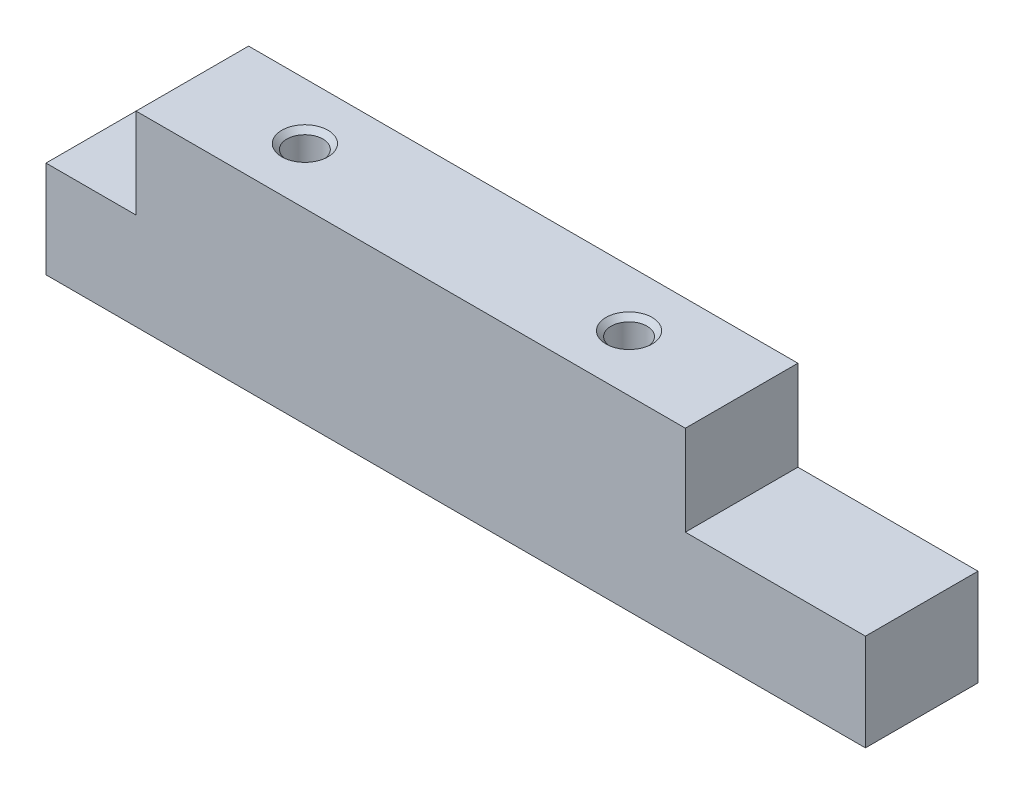
ISO-10303-21;
HEADER;
FILE_DESCRIPTION(('STEP AP214'),'2;1');
FILE_NAME('part.step','',(''),(''),'','','');
FILE_SCHEMA(('AUTOMOTIVE_DESIGN { 1 0 10303 214 1 1 1 1 }'));
ENDSEC;
DATA;
#1=APPLICATION_CONTEXT('core data for automotive mechanical design processes');
#2=APPLICATION_PROTOCOL_DEFINITION('international standard','automotive_design',2000,#1);
#3=PRODUCT_CONTEXT('',#1,'mechanical');
#4=PRODUCT('Part','Part','',(#3));
#5=PRODUCT_RELATED_PRODUCT_CATEGORY('part','',(#4));
#6=PRODUCT_DEFINITION_FORMATION('','',#4);
#7=PRODUCT_DEFINITION_CONTEXT('part definition',#1,'design');
#8=PRODUCT_DEFINITION('design','',#6,#7);
#9=PRODUCT_DEFINITION_SHAPE('','',#8);
#10=(LENGTH_UNIT() NAMED_UNIT(*) SI_UNIT(.MILLI.,.METRE.));
#11=(NAMED_UNIT(*) PLANE_ANGLE_UNIT() SI_UNIT($,.RADIAN.));
#12=(NAMED_UNIT(*) SI_UNIT($,.STERADIAN.) SOLID_ANGLE_UNIT());
#13=UNCERTAINTY_MEASURE_WITH_UNIT(LENGTH_MEASURE(1.E-05),#10,'distance_accuracy_value','');
#14=(GEOMETRIC_REPRESENTATION_CONTEXT(3) GLOBAL_UNCERTAINTY_ASSIGNED_CONTEXT((#13)) GLOBAL_UNIT_ASSIGNED_CONTEXT((#10,
#11,#12)) REPRESENTATION_CONTEXT('',''));
#15=CARTESIAN_POINT('',(0.,0.,0.));
#16=DIRECTION('',(0.,0.,1.));
#17=DIRECTION('',(1.,0.,0.));
#18=AXIS2_PLACEMENT_3D('',#15,#16,#17);
#19=CARTESIAN_POINT('',(0.,4.3,0.));
#20=DIRECTION('',(0.,-1.,0.));
#21=DIRECTION('',(0.,0.,-1.));
#22=AXIS2_PLACEMENT_3D('',#19,#20,#21);
#23=PLANE('',#22);
#24=DIRECTION('',(0.,0.,1.));
#25=VECTOR('',#24,1.);
#26=CARTESIAN_POINT('',(4.,4.3,0.));
#27=LINE('',#26,#25);
#28=CARTESIAN_POINT('',(4.,4.3,-5.));
#29=VERTEX_POINT('',#28);
#30=CARTESIAN_POINT('',(4.,4.3,0.));
#31=VERTEX_POINT('',#30);
#32=EDGE_CURVE('E54',#29,#31,#27,.T.);
#33=ORIENTED_EDGE('',*,*,#32,.F.);
#34=DIRECTION('',(-1.,0.,0.));
#35=VECTOR('',#34,1.);
#36=CARTESIAN_POINT('',(0.,4.3,-5.));
#37=LINE('',#36,#35);
#38=CARTESIAN_POINT('',(0.,4.3,-5.));
#39=VERTEX_POINT('',#38);
#40=EDGE_CURVE('E210',#29,#39,#37,.T.);
#41=ORIENTED_EDGE('',*,*,#40,.T.);
#42=DIRECTION('',(0.,0.,1.));
#43=VECTOR('',#42,1.);
#44=CARTESIAN_POINT('',(0.,4.3,0.));
#45=LINE('',#44,#43);
#46=CARTESIAN_POINT('',(0.,4.3,0.));
#47=VERTEX_POINT('',#46);
#48=EDGE_CURVE('E193',#39,#47,#45,.T.);
#49=ORIENTED_EDGE('',*,*,#48,.T.);
#50=DIRECTION('',(1.,0.,0.));
#51=VECTOR('',#50,1.);
#52=CARTESIAN_POINT('',(0.,4.3,0.));
#53=LINE('',#52,#51);
#54=EDGE_CURVE('E202',#47,#31,#53,.T.);
#55=ORIENTED_EDGE('',*,*,#54,.T.);
#56=EDGE_LOOP('',(#33,#41,#49,#55));
#57=FACE_BOUND('',#56,.T.);
#58=ADVANCED_FACE('F37',(#57),#23,.F.);
#59=DIRECTION('',(0.,0.,-1.));
#60=VECTOR('',#59,1.);
#61=CARTESIAN_POINT('',(28.4,4.3,0.));
#62=LINE('',#61,#60);
#63=CARTESIAN_POINT('',(28.4,4.3,0.));
#64=VERTEX_POINT('',#63);
#65=CARTESIAN_POINT('',(28.4,4.3,-5.));
#66=VERTEX_POINT('',#65);
#67=EDGE_CURVE('E62',#64,#66,#62,.T.);
#68=ORIENTED_EDGE('',*,*,#67,.F.);
#69=CARTESIAN_POINT('',(36.4,4.3,0.));
#70=VERTEX_POINT('',#69);
#71=EDGE_CURVE('E206',#64,#70,#53,.T.);
#72=ORIENTED_EDGE('',*,*,#71,.T.);
#73=DIRECTION('',(0.,0.,-1.));
#74=VECTOR('',#73,1.);
#75=CARTESIAN_POINT('',(36.4,4.3,0.));
#76=LINE('',#75,#74);
#77=CARTESIAN_POINT('',(36.4,4.3,-5.));
#78=VERTEX_POINT('',#77);
#79=EDGE_CURVE('E205',#70,#78,#76,.T.);
#80=ORIENTED_EDGE('',*,*,#79,.T.);
#81=EDGE_CURVE('E197',#78,#66,#37,.T.);
#82=ORIENTED_EDGE('',*,*,#81,.T.);
#83=EDGE_LOOP('',(#68,#72,#80,#82));
#84=FACE_BOUND('',#83,.T.);
#85=ADVANCED_FACE('F215',(#84),#23,.F.);
#86=CARTESIAN_POINT('',(0.,4.3,0.));
#87=DIRECTION('',(1.,0.,0.));
#88=DIRECTION('',(0.,0.,-1.));
#89=AXIS2_PLACEMENT_3D('',#86,#87,#88);
#90=PLANE('',#89);
#91=DIRECTION('',(0.,0.,1.));
#92=VECTOR('',#91,1.);
#93=CARTESIAN_POINT('',(0.,0.,0.));
#94=LINE('',#93,#92);
#95=CARTESIAN_POINT('',(0.,0.,-5.));
#96=VERTEX_POINT('',#95);
#97=CARTESIAN_POINT('',(0.,0.,0.));
#98=VERTEX_POINT('',#97);
#99=EDGE_CURVE('E174',#96,#98,#94,.T.);
#100=ORIENTED_EDGE('',*,*,#99,.T.);
#101=DIRECTION('',(0.,-1.,0.));
#102=VECTOR('',#101,1.);
#103=CARTESIAN_POINT('',(0.,4.3,0.));
#104=LINE('',#103,#102);
#105=EDGE_CURVE('E11',#47,#98,#104,.T.);
#106=ORIENTED_EDGE('',*,*,#105,.F.);
#107=ORIENTED_EDGE('',*,*,#48,.F.);
#108=DIRECTION('',(0.,-1.,0.));
#109=VECTOR('',#108,1.);
#110=CARTESIAN_POINT('',(0.,4.3,-5.));
#111=LINE('',#110,#109);
#112=EDGE_CURVE('E194',#39,#96,#111,.T.);
#113=ORIENTED_EDGE('',*,*,#112,.T.);
#114=EDGE_LOOP('',(#100,#106,#107,#113));
#115=FACE_BOUND('',#114,.T.);
#116=ADVANCED_FACE('F39',(#115),#90,.F.);
#117=CARTESIAN_POINT('',(0.,4.3,0.));
#118=DIRECTION('',(0.,0.,-1.));
#119=DIRECTION('',(-1.,0.,0.));
#120=AXIS2_PLACEMENT_3D('',#117,#118,#119);
#121=PLANE('',#120);
#122=DIRECTION('',(1.,0.,0.));
#123=VECTOR('',#122,1.);
#124=CARTESIAN_POINT('',(0.,0.,0.));
#125=LINE('',#124,#123);
#126=CARTESIAN_POINT('',(36.4,0.,0.));
#127=VERTEX_POINT('',#126);
#128=EDGE_CURVE('E178',#98,#127,#125,.T.);
#129=ORIENTED_EDGE('',*,*,#128,.T.);
#130=DIRECTION('',(0.,-1.,0.));
#131=VECTOR('',#130,1.);
#132=CARTESIAN_POINT('',(36.4,4.3,0.));
#133=LINE('',#132,#131);
#134=EDGE_CURVE('E46',#70,#127,#133,.T.);
#135=ORIENTED_EDGE('',*,*,#134,.F.);
#136=ORIENTED_EDGE('',*,*,#71,.F.);
#137=DIRECTION('',(0.,-1.,0.));
#138=VECTOR('',#137,1.);
#139=CARTESIAN_POINT('',(28.4,8.3,0.));
#140=LINE('',#139,#138);
#141=CARTESIAN_POINT('',(28.4,8.3,0.));
#142=VERTEX_POINT('',#141);
#143=EDGE_CURVE('E158',#142,#64,#140,.T.);
#144=ORIENTED_EDGE('',*,*,#143,.F.);
#145=DIRECTION('',(1.,0.,0.));
#146=VECTOR('',#145,1.);
#147=CARTESIAN_POINT('',(4.,8.3,0.));
#148=LINE('',#147,#146);
#149=CARTESIAN_POINT('',(4.,8.3,0.));
#150=VERTEX_POINT('',#149);
#151=EDGE_CURVE('E137',#150,#142,#148,.T.);
#152=ORIENTED_EDGE('',*,*,#151,.F.);
#153=DIRECTION('',(0.,-1.,0.));
#154=VECTOR('',#153,1.);
#155=CARTESIAN_POINT('',(4.,8.3,0.));
#156=LINE('',#155,#154);
#157=EDGE_CURVE('E165',#150,#31,#156,.T.);
#158=ORIENTED_EDGE('',*,*,#157,.T.);
#159=ORIENTED_EDGE('',*,*,#54,.F.);
#160=ORIENTED_EDGE('',*,*,#105,.T.);
#161=EDGE_LOOP('',(#129,#135,#136,#144,#152,#158,#159,#160));
#162=FACE_BOUND('',#161,.T.);
#163=ADVANCED_FACE('F220',(#162),#121,.F.);
#164=CARTESIAN_POINT('',(36.4,4.3,0.));
#165=DIRECTION('',(-1.,0.,0.));
#166=DIRECTION('',(0.,0.,1.));
#167=AXIS2_PLACEMENT_3D('',#164,#165,#166);
#168=PLANE('',#167);
#169=DIRECTION('',(0.,0.,-1.));
#170=VECTOR('',#169,1.);
#171=CARTESIAN_POINT('',(36.4,0.,0.));
#172=LINE('',#171,#170);
#173=CARTESIAN_POINT('',(36.4,0.,-5.));
#174=VERTEX_POINT('',#173);
#175=EDGE_CURVE('E184',#127,#174,#172,.T.);
#176=ORIENTED_EDGE('',*,*,#175,.T.);
#177=DIRECTION('',(0.,-1.,0.));
#178=VECTOR('',#177,1.);
#179=CARTESIAN_POINT('',(36.4,4.3,-5.));
#180=LINE('',#179,#178);
#181=EDGE_CURVE('E196',#78,#174,#180,.T.);
#182=ORIENTED_EDGE('',*,*,#181,.F.);
#183=ORIENTED_EDGE('',*,*,#79,.F.);
#184=ORIENTED_EDGE('',*,*,#134,.T.);
#185=EDGE_LOOP('',(#176,#182,#183,#184));
#186=FACE_BOUND('',#185,.T.);
#187=ADVANCED_FACE('F226',(#186),#168,.F.);
#188=CARTESIAN_POINT('',(0.,4.3,-5.));
#189=DIRECTION('',(0.,0.,1.));
#190=DIRECTION('',(1.,0.,0.));
#191=AXIS2_PLACEMENT_3D('',#188,#189,#190);
#192=PLANE('',#191);
#193=DIRECTION('',(-1.,0.,0.));
#194=VECTOR('',#193,1.);
#195=CARTESIAN_POINT('',(0.,0.,-5.));
#196=LINE('',#195,#194);
#197=EDGE_CURVE('E191',#174,#96,#196,.T.);
#198=ORIENTED_EDGE('',*,*,#197,.T.);
#199=ORIENTED_EDGE('',*,*,#112,.F.);
#200=ORIENTED_EDGE('',*,*,#40,.F.);
#201=DIRECTION('',(0.,-1.,0.));
#202=VECTOR('',#201,1.);
#203=CARTESIAN_POINT('',(4.,8.3,-5.));
#204=LINE('',#203,#202);
#205=CARTESIAN_POINT('',(4.,8.3,-5.));
#206=VERTEX_POINT('',#205);
#207=EDGE_CURVE('E143',#206,#29,#204,.T.);
#208=ORIENTED_EDGE('',*,*,#207,.F.);
#209=DIRECTION('',(-1.,0.,0.));
#210=VECTOR('',#209,1.);
#211=CARTESIAN_POINT('',(4.,8.3,-5.));
#212=LINE('',#211,#210);
#213=CARTESIAN_POINT('',(28.4,8.3,-5.));
#214=VERTEX_POINT('',#213);
#215=EDGE_CURVE('E141',#214,#206,#212,.T.);
#216=ORIENTED_EDGE('',*,*,#215,.F.);
#217=DIRECTION('',(0.,-1.,0.));
#218=VECTOR('',#217,1.);
#219=CARTESIAN_POINT('',(28.4,8.3,-5.));
#220=LINE('',#219,#218);
#221=EDGE_CURVE('E153',#214,#66,#220,.T.);
#222=ORIENTED_EDGE('',*,*,#221,.T.);
#223=ORIENTED_EDGE('',*,*,#81,.F.);
#224=ORIENTED_EDGE('',*,*,#181,.T.);
#225=EDGE_LOOP('',(#198,#199,#200,#208,#216,#222,#223,#224));
#226=FACE_BOUND('',#225,.T.);
#227=ADVANCED_FACE('F229',(#226),#192,.F.);
#228=CARTESIAN_POINT('',(0.,0.,0.));
#229=DIRECTION('',(0.,-1.,0.));
#230=DIRECTION('',(0.,0.,-1.));
#231=AXIS2_PLACEMENT_3D('',#228,#229,#230);
#232=PLANE('',#231);
#233=ORIENTED_EDGE('',*,*,#99,.F.);
#234=ORIENTED_EDGE('',*,*,#197,.F.);
#235=ORIENTED_EDGE('',*,*,#175,.F.);
#236=ORIENTED_EDGE('',*,*,#128,.F.);
#237=EDGE_LOOP('',(#233,#234,#235,#236));
#238=FACE_BOUND('',#237,.T.);
#239=ADVANCED_FACE('F228',(#238),#232,.T.);
#240=CARTESIAN_POINT('',(4.,8.3,0.));
#241=DIRECTION('',(1.,0.,0.));
#242=DIRECTION('',(0.,0.,-1.));
#243=AXIS2_PLACEMENT_3D('',#240,#241,#242);
#244=PLANE('',#243);
#245=ORIENTED_EDGE('',*,*,#32,.T.);
#246=ORIENTED_EDGE('',*,*,#157,.F.);
#247=DIRECTION('',(0.,0.,1.));
#248=VECTOR('',#247,1.);
#249=CARTESIAN_POINT('',(4.,8.3,0.));
#250=LINE('',#249,#248);
#251=EDGE_CURVE('E134',#206,#150,#250,.T.);
#252=ORIENTED_EDGE('',*,*,#251,.F.);
#253=ORIENTED_EDGE('',*,*,#207,.T.);
#254=EDGE_LOOP('',(#245,#246,#252,#253));
#255=FACE_BOUND('',#254,.T.);
#256=ADVANCED_FACE('F230',(#255),#244,.F.);
#257=CARTESIAN_POINT('',(28.4,8.3,0.));
#258=DIRECTION('',(-1.,0.,0.));
#259=DIRECTION('',(0.,0.,1.));
#260=AXIS2_PLACEMENT_3D('',#257,#258,#259);
#261=PLANE('',#260);
#262=ORIENTED_EDGE('',*,*,#67,.T.);
#263=ORIENTED_EDGE('',*,*,#221,.F.);
#264=DIRECTION('',(0.,0.,-1.));
#265=VECTOR('',#264,1.);
#266=CARTESIAN_POINT('',(28.4,8.3,0.));
#267=LINE('',#266,#265);
#268=EDGE_CURVE('E139',#142,#214,#267,.T.);
#269=ORIENTED_EDGE('',*,*,#268,.F.);
#270=ORIENTED_EDGE('',*,*,#143,.T.);
#271=EDGE_LOOP('',(#262,#263,#269,#270));
#272=FACE_BOUND('',#271,.T.);
#273=ADVANCED_FACE('F217',(#272),#261,.F.);
#274=CARTESIAN_POINT('',(0.,8.3,0.));
#275=DIRECTION('',(0.,-1.,0.));
#276=DIRECTION('',(0.,0.,-1.));
#277=AXIS2_PLACEMENT_3D('',#274,#275,#276);
#278=PLANE('',#277);
#279=CARTESIAN_POINT('',(9.,8.3,-2.5));
#280=DIRECTION('',(0.,1.,0.));
#281=DIRECTION('',(0.,0.,1.));
#282=AXIS2_PLACEMENT_3D('',#279,#280,#281);
#283=CIRCLE('',#282,1.025);
#284=CARTESIAN_POINT('',(9.,8.3,-1.475));
#285=VERTEX_POINT('',#284);
#286=EDGE_CURVE('E125',#285,#285,#283,.T.);
#287=ORIENTED_EDGE('',*,*,#286,.F.);
#288=EDGE_LOOP('',(#287));
#289=FACE_BOUND('',#288,.T.);
#290=CARTESIAN_POINT('',(23.4,8.3,-2.5));
#291=DIRECTION('',(0.,1.,0.));
#292=DIRECTION('',(0.,0.,1.));
#293=AXIS2_PLACEMENT_3D('',#290,#291,#292);
#294=CIRCLE('',#293,1.025);
#295=CARTESIAN_POINT('',(23.4,8.3,-1.475));
#296=VERTEX_POINT('',#295);
#297=EDGE_CURVE('E118',#296,#296,#294,.T.);
#298=ORIENTED_EDGE('',*,*,#297,.F.);
#299=EDGE_LOOP('',(#298));
#300=FACE_BOUND('',#299,.T.);
#301=ORIENTED_EDGE('',*,*,#251,.T.);
#302=ORIENTED_EDGE('',*,*,#151,.T.);
#303=ORIENTED_EDGE('',*,*,#268,.T.);
#304=ORIENTED_EDGE('',*,*,#215,.T.);
#305=EDGE_LOOP('',(#301,#302,#303,#304));
#306=FACE_BOUND('',#305,.T.);
#307=ADVANCED_FACE('F232',(#289,#300,#306),#278,.F.);
#308=CARTESIAN_POINT('',(23.4,3.3,-2.5));
#309=DIRECTION('',(0.,1.,0.));
#310=DIRECTION('',(0.,0.,1.));
#311=AXIS2_PLACEMENT_3D('',#308,#309,#310);
#312=CONICAL_SURFACE('',#311,0.799999999999999,1.02974425867665);
#313=CARTESIAN_POINT('',(23.4,2.81931150477795,-2.5));
#314=VERTEX_POINT('',#313);
#315=VERTEX_LOOP('',#314);
#316=FACE_BOUND('',#315,.T.);
#317=CARTESIAN_POINT('',(23.4,3.3,-2.5));
#318=DIRECTION('',(0.,1.,0.));
#319=DIRECTION('',(0.,0.,1.));
#320=AXIS2_PLACEMENT_3D('',#317,#318,#319);
#321=CIRCLE('',#320,0.799999999999999);
#322=CARTESIAN_POINT('',(23.4,3.3,-1.7));
#323=VERTEX_POINT('',#322);
#324=EDGE_CURVE('E131',#323,#323,#321,.T.);
#325=ORIENTED_EDGE('',*,*,#324,.T.);
#326=EDGE_LOOP('',(#325));
#327=FACE_BOUND('',#326,.T.);
#328=ADVANCED_FACE('F234',(#316,#327),#312,.F.);
#329=CARTESIAN_POINT('',(23.4,8.3,-2.5));
#330=DIRECTION('',(0.,1.,0.));
#331=DIRECTION('',(0.,0.,1.));
#332=AXIS2_PLACEMENT_3D('',#329,#330,#331);
#333=CYLINDRICAL_SURFACE('',#332,0.799999999999999);
#334=ORIENTED_EDGE('',*,*,#324,.F.);
#335=EDGE_LOOP('',(#334));
#336=FACE_BOUND('',#335,.T.);
#337=CARTESIAN_POINT('',(23.4,8.075,-2.5));
#338=DIRECTION('',(0.,1.,0.));
#339=DIRECTION('',(0.,0.,1.));
#340=AXIS2_PLACEMENT_3D('',#337,#338,#339);
#341=CIRCLE('',#340,0.799999999999999);
#342=CARTESIAN_POINT('',(23.4,8.075,-1.7));
#343=VERTEX_POINT('',#342);
#344=EDGE_CURVE('E122',#343,#343,#341,.T.);
#345=ORIENTED_EDGE('',*,*,#344,.T.);
#346=EDGE_LOOP('',(#345));
#347=FACE_BOUND('',#346,.T.);
#348=ADVANCED_FACE('F241',(#336,#347),#333,.F.);
#349=CARTESIAN_POINT('',(23.4,8.3,-2.5));
#350=DIRECTION('',(0.,1.,0.));
#351=DIRECTION('',(0.,0.,1.));
#352=AXIS2_PLACEMENT_3D('',#349,#350,#351);
#353=CONICAL_SURFACE('',#352,1.025,0.785398163397441);
#354=ORIENTED_EDGE('',*,*,#344,.F.);
#355=EDGE_LOOP('',(#354));
#356=FACE_BOUND('',#355,.T.);
#357=ORIENTED_EDGE('',*,*,#297,.T.);
#358=EDGE_LOOP('',(#357));
#359=FACE_BOUND('',#358,.T.);
#360=ADVANCED_FACE('F112',(#356,#359),#353,.F.);
#361=CARTESIAN_POINT('',(9.,3.3,-2.5));
#362=DIRECTION('',(0.,1.,0.));
#363=DIRECTION('',(0.,0.,1.));
#364=AXIS2_PLACEMENT_3D('',#361,#362,#363);
#365=CONICAL_SURFACE('',#364,0.799999999999999,1.02974425867665);
#366=CARTESIAN_POINT('',(9.,2.81931150477795,-2.5));
#367=VERTEX_POINT('',#366);
#368=VERTEX_LOOP('',#367);
#369=FACE_BOUND('',#368,.T.);
#370=CARTESIAN_POINT('',(9.,3.3,-2.5));
#371=DIRECTION('',(0.,1.,0.));
#372=DIRECTION('',(0.,0.,1.));
#373=AXIS2_PLACEMENT_3D('',#370,#371,#372);
#374=CIRCLE('',#373,0.799999999999999);
#375=CARTESIAN_POINT('',(9.,3.3,-1.7));
#376=VERTEX_POINT('',#375);
#377=EDGE_CURVE('E116',#376,#376,#374,.T.);
#378=ORIENTED_EDGE('',*,*,#377,.T.);
#379=EDGE_LOOP('',(#378));
#380=FACE_BOUND('',#379,.T.);
#381=ADVANCED_FACE('F108',(#369,#380),#365,.F.);
#382=CARTESIAN_POINT('',(9.,8.3,-2.5));
#383=DIRECTION('',(0.,1.,0.));
#384=DIRECTION('',(0.,0.,1.));
#385=AXIS2_PLACEMENT_3D('',#382,#383,#384);
#386=CYLINDRICAL_SURFACE('',#385,0.799999999999999);
#387=ORIENTED_EDGE('',*,*,#377,.F.);
#388=EDGE_LOOP('',(#387));
#389=FACE_BOUND('',#388,.T.);
#390=CARTESIAN_POINT('',(9.,8.075,-2.5));
#391=DIRECTION('',(0.,1.,0.));
#392=DIRECTION('',(0.,0.,1.));
#393=AXIS2_PLACEMENT_3D('',#390,#391,#392);
#394=CIRCLE('',#393,0.8);
#395=CARTESIAN_POINT('',(9.,8.075,-1.7));
#396=VERTEX_POINT('',#395);
#397=EDGE_CURVE('E119',#396,#396,#394,.T.);
#398=ORIENTED_EDGE('',*,*,#397,.T.);
#399=EDGE_LOOP('',(#398));
#400=FACE_BOUND('',#399,.T.);
#401=ADVANCED_FACE('F111',(#389,#400),#386,.F.);
#402=CARTESIAN_POINT('',(9.,8.3,-2.5));
#403=DIRECTION('',(0.,1.,0.));
#404=DIRECTION('',(0.,0.,1.));
#405=AXIS2_PLACEMENT_3D('',#402,#403,#404);
#406=CONICAL_SURFACE('',#405,1.025,0.785398163397441);
#407=ORIENTED_EDGE('',*,*,#397,.F.);
#408=EDGE_LOOP('',(#407));
#409=FACE_BOUND('',#408,.T.);
#410=ORIENTED_EDGE('',*,*,#286,.T.);
#411=EDGE_LOOP('',(#410));
#412=FACE_BOUND('',#411,.T.);
#413=ADVANCED_FACE('F345',(#409,#412),#406,.F.);
#414=CLOSED_SHELL('',(#58,#85,#116,#163,#187,#227,#239,#256,#273,#307,#328,#348,#360,#381,#401,#413));
#415=MANIFOLD_SOLID_BREP('B2',#414);
#416=ADVANCED_BREP_SHAPE_REPRESENTATION('',(#18,#415),#14);
#417=SHAPE_DEFINITION_REPRESENTATION(#9,#416);
ENDSEC;
END-ISO-10303-21;
